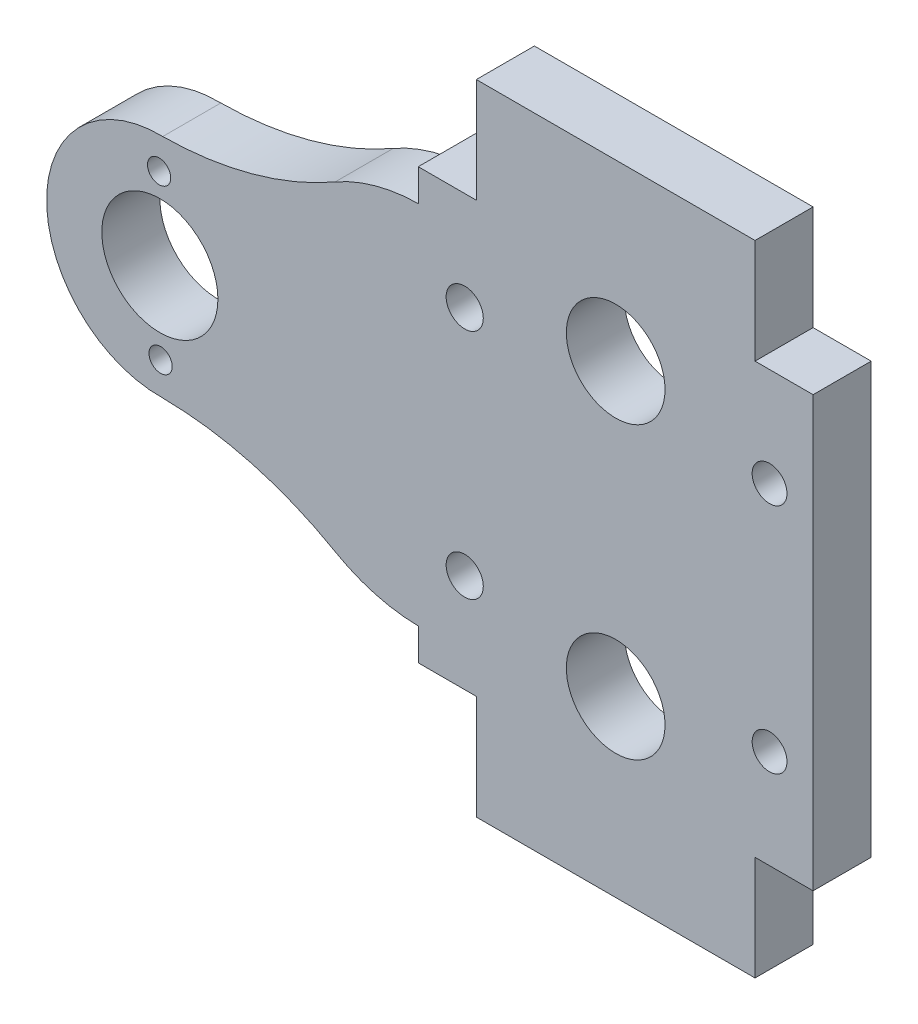
ISO-10303-21;
HEADER;
FILE_DESCRIPTION(('STEP AP214'),'2;1');
FILE_NAME('part.step','',(''),(''),'','','');
FILE_SCHEMA(('AUTOMOTIVE_DESIGN { 1 0 10303 214 1 1 1 1 }'));
ENDSEC;
DATA;
#1=APPLICATION_CONTEXT('core data for automotive mechanical design processes');
#2=APPLICATION_PROTOCOL_DEFINITION('international standard','automotive_design',2000,#1);
#3=PRODUCT_CONTEXT('',#1,'mechanical');
#4=PRODUCT('Part','Part','',(#3));
#5=PRODUCT_RELATED_PRODUCT_CATEGORY('part','',(#4));
#6=PRODUCT_DEFINITION_FORMATION('','',#4);
#7=PRODUCT_DEFINITION_CONTEXT('part definition',#1,'design');
#8=PRODUCT_DEFINITION('design','',#6,#7);
#9=PRODUCT_DEFINITION_SHAPE('','',#8);
#10=(LENGTH_UNIT() NAMED_UNIT(*) SI_UNIT(.MILLI.,.METRE.));
#11=(NAMED_UNIT(*) PLANE_ANGLE_UNIT() SI_UNIT($,.RADIAN.));
#12=(NAMED_UNIT(*) SI_UNIT($,.STERADIAN.) SOLID_ANGLE_UNIT());
#13=UNCERTAINTY_MEASURE_WITH_UNIT(LENGTH_MEASURE(1.E-05),#10,'distance_accuracy_value','');
#14=(GEOMETRIC_REPRESENTATION_CONTEXT(3) GLOBAL_UNCERTAINTY_ASSIGNED_CONTEXT((#13)) GLOBAL_UNIT_ASSIGNED_CONTEXT((#10,
#11,#12)) REPRESENTATION_CONTEXT('',''));
#15=CARTESIAN_POINT('',(0.,0.,0.));
#16=DIRECTION('',(0.,0.,1.));
#17=DIRECTION('',(1.,0.,0.));
#18=AXIS2_PLACEMENT_3D('',#15,#16,#17);
#19=CARTESIAN_POINT('',(16.700860260171,3.2922916539892,5.));
#20=DIRECTION('',(0.,0.,1.));
#21=DIRECTION('',(1.,0.,0.));
#22=AXIS2_PLACEMENT_3D('',#19,#20,#21);
#23=PLANE('',#22);
#24=CARTESIAN_POINT('',(20.5009159395274,-7.70770834601089,5.));
#25=DIRECTION('',(0.,0.,1.));
#26=DIRECTION('',(1.,0.,0.));
#27=AXIS2_PLACEMENT_3D('',#24,#25,#26);
#28=CIRCLE('',#27,1.6);
#29=CARTESIAN_POINT('',(22.1009159395274,-7.70770834601089,5.));
#30=VERTEX_POINT('',#29);
#31=EDGE_CURVE('E833',#30,#30,#28,.T.);
#32=ORIENTED_EDGE('',*,*,#31,.F.);
#33=EDGE_LOOP('',(#32));
#34=FACE_BOUND('',#33,.T.);
#35=CARTESIAN_POINT('',(20.5009159395274,12.2922916539891,5.));
#36=DIRECTION('',(0.,0.,1.));
#37=DIRECTION('',(1.,0.,0.));
#38=AXIS2_PLACEMENT_3D('',#35,#36,#37);
#39=CIRCLE('',#38,1.6);
#40=CARTESIAN_POINT('',(22.1009159395274,12.2922916539891,5.));
#41=VERTEX_POINT('',#40);
#42=EDGE_CURVE('E835',#41,#41,#39,.T.);
#43=ORIENTED_EDGE('',*,*,#42,.F.);
#44=EDGE_LOOP('',(#43));
#45=FACE_BOUND('',#44,.T.);
#46=DIRECTION('',(1.,0.,0.));
#47=VECTOR('',#46,1.);
#48=CARTESIAN_POINT('',(50.5009159395274,20.7922916539892,5.));
#49=LINE('',#48,#47);
#50=CARTESIAN_POINT('',(45.5009159395274,20.7922916539892,5.));
#51=VERTEX_POINT('',#50);
#52=CARTESIAN_POINT('',(50.5009159395274,20.7922916539892,5.));
#53=VERTEX_POINT('',#52);
#54=EDGE_CURVE('E241',#51,#53,#49,.T.);
#55=ORIENTED_EDGE('',*,*,#54,.F.);
#56=DIRECTION('',(0.,-1.,0.));
#57=VECTOR('',#56,1.);
#58=CARTESIAN_POINT('',(45.5009159395274,29.1887382633959,5.));
#59=LINE('',#58,#57);
#60=CARTESIAN_POINT('',(45.5009159395274,29.7922916539892,5.));
#61=VERTEX_POINT('',#60);
#62=EDGE_CURVE('E263',#61,#51,#59,.T.);
#63=ORIENTED_EDGE('',*,*,#62,.F.);
#64=DIRECTION('',(1.,0.,0.));
#65=VECTOR('',#64,1.);
#66=CARTESIAN_POINT('',(45.5009159395274,29.7922916539892,5.));
#67=LINE('',#66,#65);
#68=CARTESIAN_POINT('',(21.5009159395274,29.7922916539892,5.));
#69=VERTEX_POINT('',#68);
#70=EDGE_CURVE('E259',#69,#61,#67,.T.);
#71=ORIENTED_EDGE('',*,*,#70,.F.);
#72=DIRECTION('',(0.,1.,0.));
#73=VECTOR('',#72,1.);
#74=CARTESIAN_POINT('',(21.5009159395274,29.7922916539892,5.));
#75=LINE('',#74,#73);
#76=CARTESIAN_POINT('',(21.5009159395274,20.7922916539892,5.));
#77=VERTEX_POINT('',#76);
#78=EDGE_CURVE('E256',#77,#69,#75,.T.);
#79=ORIENTED_EDGE('',*,*,#78,.F.);
#80=DIRECTION('',(1.,0.,0.));
#81=VECTOR('',#80,1.);
#82=CARTESIAN_POINT('',(16.700860260171,20.7922916539892,5.));
#83=LINE('',#82,#81);
#84=CARTESIAN_POINT('',(16.5009159395274,20.7922916539892,5.));
#85=VERTEX_POINT('',#84);
#86=EDGE_CURVE('E186',#85,#77,#83,.T.);
#87=ORIENTED_EDGE('',*,*,#86,.F.);
#88=DIRECTION('',(0.,1.,0.));
#89=VECTOR('',#88,1.);
#90=CARTESIAN_POINT('',(16.5009159395274,20.7922916539892,5.));
#91=LINE('',#90,#89);
#92=CARTESIAN_POINT('',(16.5009159395274,18.0409364143949,5.));
#93=VERTEX_POINT('',#92);
#94=EDGE_CURVE('E209',#93,#85,#91,.T.);
#95=ORIENTED_EDGE('',*,*,#94,.F.);
#96=CARTESIAN_POINT('',(16.700860260171,3.2922916539892,5.));
#97=DIRECTION('',(0.,0.,1.));
#98=DIRECTION('',(1.,0.,0.));
#99=AXIS2_PLACEMENT_3D('',#96,#97,#98);
#100=CIRCLE('',#99,14.75);
#101=CARTESIAN_POINT('',(9.34226739951562,16.0756249873225,5.));
#102=VERTEX_POINT('',#101);
#103=EDGE_CURVE('E54',#93,#102,#100,.T.);
#104=ORIENTED_EDGE('',*,*,#103,.T.);
#105=CARTESIAN_POINT('',(-5.74908406047262,42.2922916539892,5.));
#106=DIRECTION('',(0.,0.,-1.));
#107=DIRECTION('',(1.,0.,0.));
#108=AXIS2_PLACEMENT_3D('',#105,#106,#107);
#109=CIRCLE('',#108,30.25);
#110=CARTESIAN_POINT('',(-5.49908406047263,12.0433247294808,5.));
#111=VERTEX_POINT('',#110);
#112=EDGE_CURVE('E339',#102,#111,#109,.T.);
#113=ORIENTED_EDGE('',*,*,#112,.T.);
#114=DIRECTION('',(3.06941559721248E-12,-1.,0.));
#115=VECTOR('',#114,1.);
#116=CARTESIAN_POINT('',(-5.49908406047263,12.0433247294808,5.));
#117=LINE('',#116,#115);
#118=CARTESIAN_POINT('',(-5.49908406047262,12.0390859987982,5.));
#119=VERTEX_POINT('',#118);
#120=EDGE_CURVE('E341',#111,#119,#117,.T.);
#121=ORIENTED_EDGE('',*,*,#120,.T.);
#122=CARTESIAN_POINT('',(-5.74908406047262,2.29229165398919,5.));
#123=DIRECTION('',(0.,0.,1.));
#124=DIRECTION('',(1.,0.,0.));
#125=AXIS2_PLACEMENT_3D('',#122,#123,#124);
#126=CIRCLE('',#125,9.75);
#127=CARTESIAN_POINT('',(-5.49908406047262,-7.45450269081977,5.));
#128=VERTEX_POINT('',#127);
#129=EDGE_CURVE('E343',#119,#128,#126,.T.);
#130=ORIENTED_EDGE('',*,*,#129,.T.);
#131=DIRECTION('',(4.09255412961497E-13,-1.,0.));
#132=VECTOR('',#131,1.);
#133=CARTESIAN_POINT('',(-5.49908406047262,-7.45450269081977,5.));
#134=LINE('',#133,#132);
#135=CARTESIAN_POINT('',(-5.49908406047262,-7.45874142150246,5.));
#136=VERTEX_POINT('',#135);
#137=EDGE_CURVE('E345',#128,#136,#134,.T.);
#138=ORIENTED_EDGE('',*,*,#137,.T.);
#139=CARTESIAN_POINT('',(-5.74908406047262,-37.7077083460108,5.));
#140=DIRECTION('',(0.,0.,-1.));
#141=DIRECTION('',(1.,0.,0.));
#142=AXIS2_PLACEMENT_3D('',#139,#140,#141);
#143=CIRCLE('',#142,30.25);
#144=CARTESIAN_POINT('',(9.3422673995156,-11.4910416793441,5.));
#145=VERTEX_POINT('',#144);
#146=EDGE_CURVE('E347',#136,#145,#143,.T.);
#147=ORIENTED_EDGE('',*,*,#146,.T.);
#148=CARTESIAN_POINT('',(16.700860260171,1.2922916539892,5.));
#149=DIRECTION('',(0.,0.,1.));
#150=DIRECTION('',(1.,0.,0.));
#151=AXIS2_PLACEMENT_3D('',#148,#149,#150);
#152=CIRCLE('',#151,14.75);
#153=CARTESIAN_POINT('',(16.5009159395274,-13.4563531064165,5.));
#154=VERTEX_POINT('',#153);
#155=EDGE_CURVE('E200',#145,#154,#152,.T.);
#156=ORIENTED_EDGE('',*,*,#155,.T.);
#157=DIRECTION('',(0.,1.,0.));
#158=VECTOR('',#157,1.);
#159=CARTESIAN_POINT('',(16.5009159395274,-13.4563531064165,5.));
#160=LINE('',#159,#158);
#161=CARTESIAN_POINT('',(16.5009159395274,-16.2077083460108,5.));
#162=VERTEX_POINT('',#161);
#163=EDGE_CURVE('E191',#162,#154,#160,.T.);
#164=ORIENTED_EDGE('',*,*,#163,.F.);
#165=DIRECTION('',(-1.,0.,0.));
#166=VECTOR('',#165,1.);
#167=CARTESIAN_POINT('',(16.700860260171,-16.2077083460108,5.));
#168=LINE('',#167,#166);
#169=CARTESIAN_POINT('',(21.5009159395274,-16.2077083460108,5.));
#170=VERTEX_POINT('',#169);
#171=EDGE_CURVE('E175',#170,#162,#168,.T.);
#172=ORIENTED_EDGE('',*,*,#171,.F.);
#173=DIRECTION('',(0.,1.,0.));
#174=VECTOR('',#173,1.);
#175=CARTESIAN_POINT('',(21.5009159395274,-25.2077083460108,5.));
#176=LINE('',#175,#174);
#177=CARTESIAN_POINT('',(21.5009159395274,-25.2077083460108,5.));
#178=VERTEX_POINT('',#177);
#179=EDGE_CURVE('E286',#178,#170,#176,.T.);
#180=ORIENTED_EDGE('',*,*,#179,.F.);
#181=DIRECTION('',(1.,0.,0.));
#182=VECTOR('',#181,1.);
#183=CARTESIAN_POINT('',(26.2509159395273,-25.2077083460108,5.));
#184=LINE('',#183,#182);
#185=CARTESIAN_POINT('',(45.5009159395274,-25.2077083460108,5.));
#186=VERTEX_POINT('',#185);
#187=EDGE_CURVE('E335',#178,#186,#184,.T.);
#188=ORIENTED_EDGE('',*,*,#187,.T.);
#189=DIRECTION('',(0.,-1.,0.));
#190=VECTOR('',#189,1.);
#191=CARTESIAN_POINT('',(45.5009159395274,-25.2077083460108,5.));
#192=LINE('',#191,#190);
#193=CARTESIAN_POINT('',(45.5009159395274,-16.2077083460108,5.));
#194=VERTEX_POINT('',#193);
#195=EDGE_CURVE('E277',#194,#186,#192,.T.);
#196=ORIENTED_EDGE('',*,*,#195,.F.);
#197=DIRECTION('',(-1.,0.,0.));
#198=VECTOR('',#197,1.);
#199=CARTESIAN_POINT('',(50.0009159395274,-16.2077083460108,5.));
#200=LINE('',#199,#198);
#201=CARTESIAN_POINT('',(50.5009159395274,-16.2077083460108,5.));
#202=VERTEX_POINT('',#201);
#203=EDGE_CURVE('E237',#202,#194,#200,.T.);
#204=ORIENTED_EDGE('',*,*,#203,.F.);
#205=DIRECTION('',(0.,-1.,0.));
#206=VECTOR('',#205,1.);
#207=CARTESIAN_POINT('',(50.5009159395274,-16.2077083460108,5.));
#208=LINE('',#207,#206);
#209=EDGE_CURVE('E234',#53,#202,#208,.T.);
#210=ORIENTED_EDGE('',*,*,#209,.F.);
#211=EDGE_LOOP('',(#55,#63,#71,#79,#87,#95,#104,#113,#121,#130,#138,#147,#156,#164,#172,#180,
#188,#196,#204,#210));
#212=FACE_BOUND('',#211,.T.);
#213=CARTESIAN_POINT('',(33.5009159395274,-10.2077083460108,5.));
#214=DIRECTION('',(0.,0.,1.));
#215=DIRECTION('',(1.,0.,0.));
#216=AXIS2_PLACEMENT_3D('',#213,#214,#215);
#217=CIRCLE('',#216,4.25000000000001);
#218=CARTESIAN_POINT('',(37.7509159395274,-10.2077083460108,5.));
#219=VERTEX_POINT('',#218);
#220=EDGE_CURVE('E311',#219,#219,#217,.T.);
#221=ORIENTED_EDGE('',*,*,#220,.F.);
#222=EDGE_LOOP('',(#221));
#223=FACE_BOUND('',#222,.T.);
#224=CARTESIAN_POINT('',(46.7509159395274,12.2922916539892,5.));
#225=DIRECTION('',(0.,0.,1.));
#226=DIRECTION('',(1.,0.,0.));
#227=AXIS2_PLACEMENT_3D('',#224,#225,#226);
#228=CIRCLE('',#227,1.5);
#229=CARTESIAN_POINT('',(48.2509159395274,12.2922916539892,5.));
#230=VERTEX_POINT('',#229);
#231=EDGE_CURVE('E323',#230,#230,#228,.T.);
#232=ORIENTED_EDGE('',*,*,#231,.F.);
#233=EDGE_LOOP('',(#232));
#234=FACE_BOUND('',#233,.T.);
#235=CARTESIAN_POINT('',(46.7509159395274,-7.70770834601081,5.));
#236=DIRECTION('',(0.,0.,1.));
#237=DIRECTION('',(1.,0.,0.));
#238=AXIS2_PLACEMENT_3D('',#235,#236,#237);
#239=CIRCLE('',#238,1.5);
#240=CARTESIAN_POINT('',(48.2509159395274,-7.70770834601081,5.));
#241=VERTEX_POINT('',#240);
#242=EDGE_CURVE('E329',#241,#241,#239,.T.);
#243=ORIENTED_EDGE('',*,*,#242,.F.);
#244=EDGE_LOOP('',(#243));
#245=FACE_BOUND('',#244,.T.);
#246=CARTESIAN_POINT('',(33.5009159395274,14.7922916539892,5.));
#247=DIRECTION('',(0.,0.,1.));
#248=DIRECTION('',(1.,0.,0.));
#249=AXIS2_PLACEMENT_3D('',#246,#247,#248);
#250=CIRCLE('',#249,4.25);
#251=CARTESIAN_POINT('',(37.7509159395274,14.7922916539892,5.));
#252=VERTEX_POINT('',#251);
#253=EDGE_CURVE('E317',#252,#252,#250,.T.);
#254=ORIENTED_EDGE('',*,*,#253,.F.);
#255=EDGE_LOOP('',(#254));
#256=FACE_BOUND('',#255,.T.);
#257=CARTESIAN_POINT('',(-5.74908406047262,2.29229165398919,5.));
#258=DIRECTION('',(0.,0.,1.));
#259=DIRECTION('',(1.,0.,0.));
#260=AXIS2_PLACEMENT_3D('',#257,#258,#259);
#261=CIRCLE('',#260,5.);
#262=CARTESIAN_POINT('',(-0.749084060472621,2.29229165398919,5.));
#263=VERTEX_POINT('',#262);
#264=EDGE_CURVE('E305',#263,#263,#261,.T.);
#265=ORIENTED_EDGE('',*,*,#264,.F.);
#266=EDGE_LOOP('',(#265));
#267=FACE_BOUND('',#266,.T.);
#268=CARTESIAN_POINT('',(-5.68662948504604,-4.70770834601081,5.));
#269=DIRECTION('',(0.,0.,1.));
#270=DIRECTION('',(1.,0.,0.));
#271=AXIS2_PLACEMENT_3D('',#268,#269,#270);
#272=CIRCLE('',#271,1.);
#273=CARTESIAN_POINT('',(-4.68662948504604,-4.70770834601081,5.));
#274=VERTEX_POINT('',#273);
#275=EDGE_CURVE('E299',#274,#274,#272,.T.);
#276=ORIENTED_EDGE('',*,*,#275,.F.);
#277=EDGE_LOOP('',(#276));
#278=FACE_BOUND('',#277,.T.);
#279=CARTESIAN_POINT('',(-5.8115386358992,9.29229165398919,5.));
#280=DIRECTION('',(0.,0.,1.));
#281=DIRECTION('',(1.,0.,0.));
#282=AXIS2_PLACEMENT_3D('',#279,#280,#281);
#283=CIRCLE('',#282,1.);
#284=CARTESIAN_POINT('',(-4.8115386358992,9.29229165398919,5.));
#285=VERTEX_POINT('',#284);
#286=EDGE_CURVE('E293',#285,#285,#283,.T.);
#287=ORIENTED_EDGE('',*,*,#286,.F.);
#288=EDGE_LOOP('',(#287));
#289=FACE_BOUND('',#288,.T.);
#290=ADVANCED_FACE('F39',(#34,#45,#212,#223,#234,#245,#256,#267,#278,#289),#23,.T.);
#291=CARTESIAN_POINT('',(16.700860260171,3.2922916539892,0.));
#292=DIRECTION('',(0.,0.,1.));
#293=DIRECTION('',(1.,0.,0.));
#294=AXIS2_PLACEMENT_3D('',#291,#292,#293);
#295=PLANE('',#294);
#296=DIRECTION('',(0.,-1.,0.));
#297=VECTOR('',#296,1.);
#298=CARTESIAN_POINT('',(45.5009159395274,29.1887382633959,0.));
#299=LINE('',#298,#297);
#300=CARTESIAN_POINT('',(45.5009159395274,29.7922916539892,0.));
#301=VERTEX_POINT('',#300);
#302=CARTESIAN_POINT('',(45.5009159395274,20.7922916539892,0.));
#303=VERTEX_POINT('',#302);
#304=EDGE_CURVE('E260',#301,#303,#299,.T.);
#305=ORIENTED_EDGE('',*,*,#304,.T.);
#306=DIRECTION('',(1.,0.,0.));
#307=VECTOR('',#306,1.);
#308=CARTESIAN_POINT('',(50.5009159395274,20.7922916539892,0.));
#309=LINE('',#308,#307);
#310=CARTESIAN_POINT('',(50.5009159395274,20.7922916539892,0.));
#311=VERTEX_POINT('',#310);
#312=EDGE_CURVE('E238',#303,#311,#309,.T.);
#313=ORIENTED_EDGE('',*,*,#312,.T.);
#314=DIRECTION('',(0.,-1.,0.));
#315=VECTOR('',#314,1.);
#316=CARTESIAN_POINT('',(50.5009159395274,-16.2077083460108,0.));
#317=LINE('',#316,#315);
#318=CARTESIAN_POINT('',(50.5009159395274,-16.2077083460108,0.));
#319=VERTEX_POINT('',#318);
#320=EDGE_CURVE('E233',#311,#319,#317,.T.);
#321=ORIENTED_EDGE('',*,*,#320,.T.);
#322=DIRECTION('',(-1.,0.,0.));
#323=VECTOR('',#322,1.);
#324=CARTESIAN_POINT('',(50.0009159395274,-16.2077083460108,0.));
#325=LINE('',#324,#323);
#326=CARTESIAN_POINT('',(45.5009159395274,-16.2077083460108,0.));
#327=VERTEX_POINT('',#326);
#328=EDGE_CURVE('E247',#319,#327,#325,.T.);
#329=ORIENTED_EDGE('',*,*,#328,.T.);
#330=DIRECTION('',(0.,-1.,0.));
#331=VECTOR('',#330,1.);
#332=CARTESIAN_POINT('',(45.5009159395274,-25.2077083460108,0.));
#333=LINE('',#332,#331);
#334=CARTESIAN_POINT('',(45.5009159395274,-25.2077083460108,0.));
#335=VERTEX_POINT('',#334);
#336=EDGE_CURVE('E275',#327,#335,#333,.T.);
#337=ORIENTED_EDGE('',*,*,#336,.T.);
#338=DIRECTION('',(1.,0.,0.));
#339=VECTOR('',#338,1.);
#340=CARTESIAN_POINT('',(26.2509159395273,-25.2077083460108,0.));
#341=LINE('',#340,#339);
#342=CARTESIAN_POINT('',(21.5009159395274,-25.2077083460108,0.));
#343=VERTEX_POINT('',#342);
#344=EDGE_CURVE('E332',#343,#335,#341,.T.);
#345=ORIENTED_EDGE('',*,*,#344,.F.);
#346=DIRECTION('',(0.,1.,0.));
#347=VECTOR('',#346,1.);
#348=CARTESIAN_POINT('',(21.5009159395274,-25.2077083460108,0.));
#349=LINE('',#348,#347);
#350=CARTESIAN_POINT('',(21.5009159395274,-16.2077083460108,0.));
#351=VERTEX_POINT('',#350);
#352=EDGE_CURVE('E285',#343,#351,#349,.T.);
#353=ORIENTED_EDGE('',*,*,#352,.T.);
#354=DIRECTION('',(1.,0.,0.));
#355=VECTOR('',#354,1.);
#356=CARTESIAN_POINT('',(21.2509159395274,-16.2077083460108,0.));
#357=LINE('',#356,#355);
#358=CARTESIAN_POINT('',(16.5009159395274,-16.2077083460108,0.));
#359=VERTEX_POINT('',#358);
#360=EDGE_CURVE('E223',#359,#351,#357,.T.);
#361=ORIENTED_EDGE('',*,*,#360,.F.);
#362=DIRECTION('',(0.,1.,0.));
#363=VECTOR('',#362,1.);
#364=CARTESIAN_POINT('',(16.5009159395274,-13.4563531064165,0.));
#365=LINE('',#364,#363);
#366=CARTESIAN_POINT('',(16.5009159395274,-13.4563531064165,0.));
#367=VERTEX_POINT('',#366);
#368=EDGE_CURVE('E194',#359,#367,#365,.T.);
#369=ORIENTED_EDGE('',*,*,#368,.T.);
#370=CARTESIAN_POINT('',(16.700860260171,1.2922916539892,0.));
#371=DIRECTION('',(0.,0.,1.));
#372=DIRECTION('',(1.,0.,0.));
#373=AXIS2_PLACEMENT_3D('',#370,#371,#372);
#374=CIRCLE('',#373,14.75);
#375=CARTESIAN_POINT('',(9.3422673995156,-11.4910416793441,0.));
#376=VERTEX_POINT('',#375);
#377=EDGE_CURVE('E337',#376,#367,#374,.T.);
#378=ORIENTED_EDGE('',*,*,#377,.F.);
#379=CARTESIAN_POINT('',(-5.74908406047262,-37.7077083460108,0.));
#380=DIRECTION('',(0.,0.,-1.));
#381=DIRECTION('',(1.,0.,0.));
#382=AXIS2_PLACEMENT_3D('',#379,#380,#381);
#383=CIRCLE('',#382,30.25);
#384=CARTESIAN_POINT('',(-5.49908406047262,-7.45874142150246,0.));
#385=VERTEX_POINT('',#384);
#386=EDGE_CURVE('E362',#385,#376,#383,.T.);
#387=ORIENTED_EDGE('',*,*,#386,.F.);
#388=DIRECTION('',(4.09255412961497E-13,-1.,0.));
#389=VECTOR('',#388,1.);
#390=CARTESIAN_POINT('',(-5.49908406047262,-7.45450269081977,0.));
#391=LINE('',#390,#389);
#392=CARTESIAN_POINT('',(-5.49908406047262,-7.45450269081977,0.));
#393=VERTEX_POINT('',#392);
#394=EDGE_CURVE('E360',#393,#385,#391,.T.);
#395=ORIENTED_EDGE('',*,*,#394,.F.);
#396=CARTESIAN_POINT('',(-5.74908406047262,2.29229165398919,0.));
#397=DIRECTION('',(0.,0.,1.));
#398=DIRECTION('',(1.,0.,0.));
#399=AXIS2_PLACEMENT_3D('',#396,#397,#398);
#400=CIRCLE('',#399,9.75);
#401=CARTESIAN_POINT('',(-5.49908406047262,12.0390859987982,0.));
#402=VERTEX_POINT('',#401);
#403=EDGE_CURVE('E358',#402,#393,#400,.T.);
#404=ORIENTED_EDGE('',*,*,#403,.F.);
#405=DIRECTION('',(3.06941559721248E-12,-1.,0.));
#406=VECTOR('',#405,1.);
#407=CARTESIAN_POINT('',(-5.49908406047263,12.0433247294808,0.));
#408=LINE('',#407,#406);
#409=CARTESIAN_POINT('',(-5.49908406047263,12.0433247294808,0.));
#410=VERTEX_POINT('',#409);
#411=EDGE_CURVE('E356',#410,#402,#408,.T.);
#412=ORIENTED_EDGE('',*,*,#411,.F.);
#413=CARTESIAN_POINT('',(-5.74908406047262,42.2922916539892,0.));
#414=DIRECTION('',(0.,0.,-1.));
#415=DIRECTION('',(1.,0.,0.));
#416=AXIS2_PLACEMENT_3D('',#413,#414,#415);
#417=CIRCLE('',#416,30.25);
#418=CARTESIAN_POINT('',(9.34226739951562,16.0756249873225,0.));
#419=VERTEX_POINT('',#418);
#420=EDGE_CURVE('E354',#419,#410,#417,.T.);
#421=ORIENTED_EDGE('',*,*,#420,.F.);
#422=CARTESIAN_POINT('',(16.700860260171,3.2922916539892,0.));
#423=DIRECTION('',(0.,0.,1.));
#424=DIRECTION('',(1.,0.,0.));
#425=AXIS2_PLACEMENT_3D('',#422,#423,#424);
#426=CIRCLE('',#425,14.75);
#427=CARTESIAN_POINT('',(16.5009159395274,18.0409364143949,0.));
#428=VERTEX_POINT('',#427);
#429=EDGE_CURVE('E352',#428,#419,#426,.T.);
#430=ORIENTED_EDGE('',*,*,#429,.F.);
#431=DIRECTION('',(0.,1.,0.));
#432=VECTOR('',#431,1.);
#433=CARTESIAN_POINT('',(16.5009159395274,20.7922916539892,0.));
#434=LINE('',#433,#432);
#435=CARTESIAN_POINT('',(16.5009159395274,20.7922916539892,0.));
#436=VERTEX_POINT('',#435);
#437=EDGE_CURVE('E207',#428,#436,#434,.T.);
#438=ORIENTED_EDGE('',*,*,#437,.T.);
#439=DIRECTION('',(-1.,0.,0.));
#440=VECTOR('',#439,1.);
#441=CARTESIAN_POINT('',(21.5009159395274,20.7922916539892,0.));
#442=LINE('',#441,#440);
#443=CARTESIAN_POINT('',(21.5009159395274,20.7922916539892,0.));
#444=VERTEX_POINT('',#443);
#445=EDGE_CURVE('E217',#444,#436,#442,.T.);
#446=ORIENTED_EDGE('',*,*,#445,.F.);
#447=DIRECTION('',(0.,1.,0.));
#448=VECTOR('',#447,1.);
#449=CARTESIAN_POINT('',(21.5009159395274,29.7922916539892,0.));
#450=LINE('',#449,#448);
#451=CARTESIAN_POINT('',(21.5009159395274,29.7922916539892,0.));
#452=VERTEX_POINT('',#451);
#453=EDGE_CURVE('E254',#444,#452,#450,.T.);
#454=ORIENTED_EDGE('',*,*,#453,.T.);
#455=DIRECTION('',(1.,0.,0.));
#456=VECTOR('',#455,1.);
#457=CARTESIAN_POINT('',(45.5009159395274,29.7922916539892,0.));
#458=LINE('',#457,#456);
#459=EDGE_CURVE('E269',#452,#301,#458,.T.);
#460=ORIENTED_EDGE('',*,*,#459,.T.);
#461=EDGE_LOOP('',(#305,#313,#321,#329,#337,#345,#353,#361,#369,#378,#387,#395,#404,#412,#421,
#430,#438,#446,#454,#460));
#462=FACE_BOUND('',#461,.T.);
#463=CARTESIAN_POINT('',(46.7509159395274,-7.70770834601081,0.));
#464=DIRECTION('',(0.,0.,1.));
#465=DIRECTION('',(1.,0.,0.));
#466=AXIS2_PLACEMENT_3D('',#463,#464,#465);
#467=CIRCLE('',#466,1.5);
#468=CARTESIAN_POINT('',(48.2509159395274,-7.70770834601081,0.));
#469=VERTEX_POINT('',#468);
#470=EDGE_CURVE('E326',#469,#469,#467,.T.);
#471=ORIENTED_EDGE('',*,*,#470,.T.);
#472=EDGE_LOOP('',(#471));
#473=FACE_BOUND('',#472,.T.);
#474=CARTESIAN_POINT('',(46.7509159395274,12.2922916539892,0.));
#475=DIRECTION('',(0.,0.,1.));
#476=DIRECTION('',(1.,0.,0.));
#477=AXIS2_PLACEMENT_3D('',#474,#475,#476);
#478=CIRCLE('',#477,1.5);
#479=CARTESIAN_POINT('',(48.2509159395274,12.2922916539892,0.));
#480=VERTEX_POINT('',#479);
#481=EDGE_CURVE('E320',#480,#480,#478,.T.);
#482=ORIENTED_EDGE('',*,*,#481,.T.);
#483=EDGE_LOOP('',(#482));
#484=FACE_BOUND('',#483,.T.);
#485=CARTESIAN_POINT('',(33.5009159395274,14.7922916539892,0.));
#486=DIRECTION('',(0.,0.,1.));
#487=DIRECTION('',(1.,0.,0.));
#488=AXIS2_PLACEMENT_3D('',#485,#486,#487);
#489=CIRCLE('',#488,4.25);
#490=CARTESIAN_POINT('',(37.7509159395274,14.7922916539892,0.));
#491=VERTEX_POINT('',#490);
#492=EDGE_CURVE('E314',#491,#491,#489,.T.);
#493=ORIENTED_EDGE('',*,*,#492,.T.);
#494=EDGE_LOOP('',(#493));
#495=FACE_BOUND('',#494,.T.);
#496=CARTESIAN_POINT('',(33.5009159395274,-10.2077083460108,0.));
#497=DIRECTION('',(0.,0.,1.));
#498=DIRECTION('',(1.,0.,0.));
#499=AXIS2_PLACEMENT_3D('',#496,#497,#498);
#500=CIRCLE('',#499,4.25000000000001);
#501=CARTESIAN_POINT('',(37.7509159395274,-10.2077083460108,0.));
#502=VERTEX_POINT('',#501);
#503=EDGE_CURVE('E308',#502,#502,#500,.T.);
#504=ORIENTED_EDGE('',*,*,#503,.T.);
#505=EDGE_LOOP('',(#504));
#506=FACE_BOUND('',#505,.T.);
#507=CARTESIAN_POINT('',(20.5009159395274,12.2922916539891,0.));
#508=DIRECTION('',(0.,0.,1.));
#509=DIRECTION('',(1.,0.,0.));
#510=AXIS2_PLACEMENT_3D('',#507,#508,#509);
#511=CIRCLE('',#510,1.6);
#512=CARTESIAN_POINT('',(22.1009159395274,12.2922916539891,0.));
#513=VERTEX_POINT('',#512);
#514=EDGE_CURVE('E202',#513,#513,#511,.T.);
#515=ORIENTED_EDGE('',*,*,#514,.T.);
#516=EDGE_LOOP('',(#515));
#517=FACE_BOUND('',#516,.T.);
#518=CARTESIAN_POINT('',(20.5009159395274,-7.70770834601089,0.));
#519=DIRECTION('',(0.,0.,1.));
#520=DIRECTION('',(1.,0.,0.));
#521=AXIS2_PLACEMENT_3D('',#518,#519,#520);
#522=CIRCLE('',#521,1.6);
#523=CARTESIAN_POINT('',(22.1009159395274,-7.70770834601089,0.));
#524=VERTEX_POINT('',#523);
#525=EDGE_CURVE('E823',#524,#524,#522,.T.);
#526=ORIENTED_EDGE('',*,*,#525,.T.);
#527=EDGE_LOOP('',(#526));
#528=FACE_BOUND('',#527,.T.);
#529=CARTESIAN_POINT('',(-5.74908406047262,2.29229165398919,0.));
#530=DIRECTION('',(0.,0.,1.));
#531=DIRECTION('',(1.,0.,0.));
#532=AXIS2_PLACEMENT_3D('',#529,#530,#531);
#533=CIRCLE('',#532,5.);
#534=CARTESIAN_POINT('',(-0.749084060472621,2.29229165398919,0.));
#535=VERTEX_POINT('',#534);
#536=EDGE_CURVE('E302',#535,#535,#533,.T.);
#537=ORIENTED_EDGE('',*,*,#536,.T.);
#538=EDGE_LOOP('',(#537));
#539=FACE_BOUND('',#538,.T.);
#540=CARTESIAN_POINT('',(-5.68662948504604,-4.70770834601081,0.));
#541=DIRECTION('',(0.,0.,1.));
#542=DIRECTION('',(1.,0.,0.));
#543=AXIS2_PLACEMENT_3D('',#540,#541,#542);
#544=CIRCLE('',#543,1.);
#545=CARTESIAN_POINT('',(-4.68662948504604,-4.70770834601081,0.));
#546=VERTEX_POINT('',#545);
#547=EDGE_CURVE('E296',#546,#546,#544,.T.);
#548=ORIENTED_EDGE('',*,*,#547,.T.);
#549=EDGE_LOOP('',(#548));
#550=FACE_BOUND('',#549,.T.);
#551=CARTESIAN_POINT('',(-5.8115386358992,9.29229165398919,0.));
#552=DIRECTION('',(0.,0.,1.));
#553=DIRECTION('',(1.,0.,0.));
#554=AXIS2_PLACEMENT_3D('',#551,#552,#553);
#555=CIRCLE('',#554,1.);
#556=CARTESIAN_POINT('',(-4.8115386358992,9.29229165398919,0.));
#557=VERTEX_POINT('',#556);
#558=EDGE_CURVE('E292',#557,#557,#555,.T.);
#559=ORIENTED_EDGE('',*,*,#558,.T.);
#560=EDGE_LOOP('',(#559));
#561=FACE_BOUND('',#560,.T.);
#562=ADVANCED_FACE('F388',(#462,#473,#484,#495,#506,#517,#528,#539,#550,#561),#295,.F.);
#563=CARTESIAN_POINT('',(26.2509159395273,-25.2077083460108,5.));
#564=DIRECTION('',(0.,1.,0.));
#565=DIRECTION('',(0.,0.,1.));
#566=AXIS2_PLACEMENT_3D('',#563,#564,#565);
#567=PLANE('',#566);
#568=ORIENTED_EDGE('',*,*,#344,.T.);
#569=DIRECTION('',(0.,0.,-1.));
#570=VECTOR('',#569,1.);
#571=CARTESIAN_POINT('',(45.5009159395274,-25.2077083460108,5.));
#572=LINE('',#571,#570);
#573=EDGE_CURVE('E280',#186,#335,#572,.T.);
#574=ORIENTED_EDGE('',*,*,#573,.F.);
#575=ORIENTED_EDGE('',*,*,#187,.F.);
#576=DIRECTION('',(0.,0.,-1.));
#577=VECTOR('',#576,1.);
#578=CARTESIAN_POINT('',(21.5009159395274,-25.2077083460108,5.));
#579=LINE('',#578,#577);
#580=EDGE_CURVE('E288',#178,#343,#579,.T.);
#581=ORIENTED_EDGE('',*,*,#580,.T.);
#582=EDGE_LOOP('',(#568,#574,#575,#581));
#583=FACE_BOUND('',#582,.T.);
#584=ADVANCED_FACE('F41',(#583),#567,.F.);
#585=CARTESIAN_POINT('',(16.700860260171,3.2922916539892,5.));
#586=DIRECTION('',(0.,0.,-1.));
#587=DIRECTION('',(-1.,0.,0.));
#588=AXIS2_PLACEMENT_3D('',#585,#586,#587);
#589=CYLINDRICAL_SURFACE('',#588,14.75);
#590=ORIENTED_EDGE('',*,*,#103,.F.);
#591=DIRECTION('',(0.,0.,-1.));
#592=VECTOR('',#591,1.);
#593=CARTESIAN_POINT('',(16.5009159395274,18.0409364143949,5.));
#594=LINE('',#593,#592);
#595=EDGE_CURVE('E58',#93,#428,#594,.T.);
#596=ORIENTED_EDGE('',*,*,#595,.T.);
#597=ORIENTED_EDGE('',*,*,#429,.T.);
#598=DIRECTION('',(0.,0.,-1.));
#599=VECTOR('',#598,1.);
#600=CARTESIAN_POINT('',(9.34226739951562,16.0756249873225,5.));
#601=LINE('',#600,#599);
#602=EDGE_CURVE('E11',#102,#419,#601,.T.);
#603=ORIENTED_EDGE('',*,*,#602,.F.);
#604=EDGE_LOOP('',(#590,#596,#597,#603));
#605=FACE_BOUND('',#604,.T.);
#606=ADVANCED_FACE('F404',(#605),#589,.T.);
#607=CARTESIAN_POINT('',(-5.74908406047262,42.2922916539892,5.));
#608=DIRECTION('',(0.,0.,-1.));
#609=DIRECTION('',(-1.,0.,0.));
#610=AXIS2_PLACEMENT_3D('',#607,#608,#609);
#611=CYLINDRICAL_SURFACE('',#610,30.25);
#612=ORIENTED_EDGE('',*,*,#420,.T.);
#613=DIRECTION('',(0.,0.,-1.));
#614=VECTOR('',#613,1.);
#615=CARTESIAN_POINT('',(-5.49908406047263,12.0433247294808,5.));
#616=LINE('',#615,#614);
#617=EDGE_CURVE('E47',#111,#410,#616,.T.);
#618=ORIENTED_EDGE('',*,*,#617,.F.);
#619=ORIENTED_EDGE('',*,*,#112,.F.);
#620=ORIENTED_EDGE('',*,*,#602,.T.);
#621=EDGE_LOOP('',(#612,#618,#619,#620));
#622=FACE_BOUND('',#621,.T.);
#623=ADVANCED_FACE('F403',(#622),#611,.F.);
#624=CARTESIAN_POINT('',(-5.49908406047263,12.0433247294808,5.));
#625=DIRECTION('',(1.,3.06941559721249E-12,0.));
#626=DIRECTION('',(-3.06941559721249E-12,1.,0.));
#627=AXIS2_PLACEMENT_3D('',#624,#625,#626);
#628=PLANE('',#627);
#629=ORIENTED_EDGE('',*,*,#411,.T.);
#630=DIRECTION('',(0.,0.,-1.));
#631=VECTOR('',#630,1.);
#632=CARTESIAN_POINT('',(-5.49908406047262,12.0390859987982,5.));
#633=LINE('',#632,#631);
#634=EDGE_CURVE('E374',#119,#402,#633,.T.);
#635=ORIENTED_EDGE('',*,*,#634,.F.);
#636=ORIENTED_EDGE('',*,*,#120,.F.);
#637=ORIENTED_EDGE('',*,*,#617,.T.);
#638=EDGE_LOOP('',(#629,#635,#636,#637));
#639=FACE_BOUND('',#638,.T.);
#640=ADVANCED_FACE('F381',(#639),#628,.F.);
#641=CARTESIAN_POINT('',(-5.74908406047262,2.29229165398919,5.));
#642=DIRECTION('',(0.,0.,-1.));
#643=DIRECTION('',(-1.,0.,0.));
#644=AXIS2_PLACEMENT_3D('',#641,#642,#643);
#645=CYLINDRICAL_SURFACE('',#644,9.75);
#646=ORIENTED_EDGE('',*,*,#403,.T.);
#647=DIRECTION('',(0.,0.,-1.));
#648=VECTOR('',#647,1.);
#649=CARTESIAN_POINT('',(-5.49908406047262,-7.45450269081977,5.));
#650=LINE('',#649,#648);
#651=EDGE_CURVE('E371',#128,#393,#650,.T.);
#652=ORIENTED_EDGE('',*,*,#651,.F.);
#653=ORIENTED_EDGE('',*,*,#129,.F.);
#654=ORIENTED_EDGE('',*,*,#634,.T.);
#655=EDGE_LOOP('',(#646,#652,#653,#654));
#656=FACE_BOUND('',#655,.T.);
#657=ADVANCED_FACE('F394',(#656),#645,.T.);
#658=CARTESIAN_POINT('',(-5.49908406047262,-7.45450269081977,5.));
#659=DIRECTION('',(1.,4.09255412961497E-13,0.));
#660=DIRECTION('',(-4.09255412961497E-13,1.,0.));
#661=AXIS2_PLACEMENT_3D('',#658,#659,#660);
#662=PLANE('',#661);
#663=ORIENTED_EDGE('',*,*,#394,.T.);
#664=DIRECTION('',(0.,0.,-1.));
#665=VECTOR('',#664,1.);
#666=CARTESIAN_POINT('',(-5.49908406047262,-7.45874142150246,5.));
#667=LINE('',#666,#665);
#668=EDGE_CURVE('E368',#136,#385,#667,.T.);
#669=ORIENTED_EDGE('',*,*,#668,.F.);
#670=ORIENTED_EDGE('',*,*,#137,.F.);
#671=ORIENTED_EDGE('',*,*,#651,.T.);
#672=EDGE_LOOP('',(#663,#669,#670,#671));
#673=FACE_BOUND('',#672,.T.);
#674=ADVANCED_FACE('F398',(#673),#662,.F.);
#675=CARTESIAN_POINT('',(-5.74908406047262,-37.7077083460108,5.));
#676=DIRECTION('',(0.,0.,-1.));
#677=DIRECTION('',(-1.,0.,0.));
#678=AXIS2_PLACEMENT_3D('',#675,#676,#677);
#679=CYLINDRICAL_SURFACE('',#678,30.25);
#680=ORIENTED_EDGE('',*,*,#386,.T.);
#681=DIRECTION('',(0.,0.,-1.));
#682=VECTOR('',#681,1.);
#683=CARTESIAN_POINT('',(9.3422673995156,-11.4910416793441,5.));
#684=LINE('',#683,#682);
#685=EDGE_CURVE('E350',#145,#376,#684,.T.);
#686=ORIENTED_EDGE('',*,*,#685,.F.);
#687=ORIENTED_EDGE('',*,*,#146,.F.);
#688=ORIENTED_EDGE('',*,*,#668,.T.);
#689=EDGE_LOOP('',(#680,#686,#687,#688));
#690=FACE_BOUND('',#689,.T.);
#691=ADVANCED_FACE('F471',(#690),#679,.F.);
#692=CARTESIAN_POINT('',(16.700860260171,1.2922916539892,5.));
#693=DIRECTION('',(0.,0.,-1.));
#694=DIRECTION('',(-1.,0.,0.));
#695=AXIS2_PLACEMENT_3D('',#692,#693,#694);
#696=CYLINDRICAL_SURFACE('',#695,14.75);
#697=ORIENTED_EDGE('',*,*,#377,.T.);
#698=DIRECTION('',(0.,0.,-1.));
#699=VECTOR('',#698,1.);
#700=CARTESIAN_POINT('',(16.5009159395274,-13.4563531064165,5.));
#701=LINE('',#700,#699);
#702=EDGE_CURVE('E195',#154,#367,#701,.T.);
#703=ORIENTED_EDGE('',*,*,#702,.F.);
#704=ORIENTED_EDGE('',*,*,#155,.F.);
#705=ORIENTED_EDGE('',*,*,#685,.T.);
#706=EDGE_LOOP('',(#697,#703,#704,#705));
#707=FACE_BOUND('',#706,.T.);
#708=ADVANCED_FACE('F468',(#707),#696,.T.);
#709=CARTESIAN_POINT('',(46.7509159395274,-7.70770834601081,5.));
#710=DIRECTION('',(0.,0.,-1.));
#711=DIRECTION('',(-1.,0.,0.));
#712=AXIS2_PLACEMENT_3D('',#709,#710,#711);
#713=CYLINDRICAL_SURFACE('',#712,1.5);
#714=ORIENTED_EDGE('',*,*,#242,.T.);
#715=EDGE_LOOP('',(#714));
#716=FACE_BOUND('',#715,.T.);
#717=ORIENTED_EDGE('',*,*,#470,.F.);
#718=EDGE_LOOP('',(#717));
#719=FACE_BOUND('',#718,.T.);
#720=ADVANCED_FACE('F465',(#716,#719),#713,.F.);
#721=CARTESIAN_POINT('',(46.7509159395274,12.2922916539892,5.));
#722=DIRECTION('',(0.,0.,-1.));
#723=DIRECTION('',(-1.,0.,0.));
#724=AXIS2_PLACEMENT_3D('',#721,#722,#723);
#725=CYLINDRICAL_SURFACE('',#724,1.5);
#726=ORIENTED_EDGE('',*,*,#231,.T.);
#727=EDGE_LOOP('',(#726));
#728=FACE_BOUND('',#727,.T.);
#729=ORIENTED_EDGE('',*,*,#481,.F.);
#730=EDGE_LOOP('',(#729));
#731=FACE_BOUND('',#730,.T.);
#732=ADVANCED_FACE('F757',(#728,#731),#725,.F.);
#733=CARTESIAN_POINT('',(33.5009159395274,14.7922916539892,5.));
#734=DIRECTION('',(0.,0.,-1.));
#735=DIRECTION('',(-1.,0.,0.));
#736=AXIS2_PLACEMENT_3D('',#733,#734,#735);
#737=CYLINDRICAL_SURFACE('',#736,4.25);
#738=ORIENTED_EDGE('',*,*,#253,.T.);
#739=EDGE_LOOP('',(#738));
#740=FACE_BOUND('',#739,.T.);
#741=ORIENTED_EDGE('',*,*,#492,.F.);
#742=EDGE_LOOP('',(#741));
#743=FACE_BOUND('',#742,.T.);
#744=ADVANCED_FACE('F748',(#740,#743),#737,.F.);
#745=CARTESIAN_POINT('',(33.5009159395274,-10.2077083460108,5.));
#746=DIRECTION('',(0.,0.,-1.));
#747=DIRECTION('',(-1.,0.,0.));
#748=AXIS2_PLACEMENT_3D('',#745,#746,#747);
#749=CYLINDRICAL_SURFACE('',#748,4.25000000000001);
#750=ORIENTED_EDGE('',*,*,#220,.T.);
#751=EDGE_LOOP('',(#750));
#752=FACE_BOUND('',#751,.T.);
#753=ORIENTED_EDGE('',*,*,#503,.F.);
#754=EDGE_LOOP('',(#753));
#755=FACE_BOUND('',#754,.T.);
#756=ADVANCED_FACE('F739',(#752,#755),#749,.F.);
#757=CARTESIAN_POINT('',(-5.74908406047262,2.29229165398919,5.));
#758=DIRECTION('',(0.,0.,-1.));
#759=DIRECTION('',(-1.,0.,0.));
#760=AXIS2_PLACEMENT_3D('',#757,#758,#759);
#761=CYLINDRICAL_SURFACE('',#760,5.);
#762=ORIENTED_EDGE('',*,*,#264,.T.);
#763=EDGE_LOOP('',(#762));
#764=FACE_BOUND('',#763,.T.);
#765=ORIENTED_EDGE('',*,*,#536,.F.);
#766=EDGE_LOOP('',(#765));
#767=FACE_BOUND('',#766,.T.);
#768=ADVANCED_FACE('F730',(#764,#767),#761,.F.);
#769=CARTESIAN_POINT('',(-5.68662948504604,-4.70770834601081,5.));
#770=DIRECTION('',(0.,0.,-1.));
#771=DIRECTION('',(-1.,0.,0.));
#772=AXIS2_PLACEMENT_3D('',#769,#770,#771);
#773=CYLINDRICAL_SURFACE('',#772,1.);
#774=ORIENTED_EDGE('',*,*,#275,.T.);
#775=EDGE_LOOP('',(#774));
#776=FACE_BOUND('',#775,.T.);
#777=ORIENTED_EDGE('',*,*,#547,.F.);
#778=EDGE_LOOP('',(#777));
#779=FACE_BOUND('',#778,.T.);
#780=ADVANCED_FACE('F452',(#776,#779),#773,.F.);
#781=CARTESIAN_POINT('',(-5.8115386358992,9.29229165398919,5.));
#782=DIRECTION('',(0.,0.,-1.));
#783=DIRECTION('',(-1.,0.,0.));
#784=AXIS2_PLACEMENT_3D('',#781,#782,#783);
#785=CYLINDRICAL_SURFACE('',#784,1.);
#786=ORIENTED_EDGE('',*,*,#286,.T.);
#787=EDGE_LOOP('',(#786));
#788=FACE_BOUND('',#787,.T.);
#789=ORIENTED_EDGE('',*,*,#558,.F.);
#790=EDGE_LOOP('',(#789));
#791=FACE_BOUND('',#790,.T.);
#792=ADVANCED_FACE('F445',(#788,#791),#785,.F.);
#793=CARTESIAN_POINT('',(21.5009159395274,-25.2077083460108,5.));
#794=DIRECTION('',(-1.,0.,0.));
#795=DIRECTION('',(0.,-1.,0.));
#796=AXIS2_PLACEMENT_3D('',#793,#794,#795);
#797=PLANE('',#796);
#798=ORIENTED_EDGE('',*,*,#352,.F.);
#799=ORIENTED_EDGE('',*,*,#580,.F.);
#800=ORIENTED_EDGE('',*,*,#179,.T.);
#801=DIRECTION('',(0.,0.,-1.));
#802=VECTOR('',#801,1.);
#803=CARTESIAN_POINT('',(21.5009159395274,-16.2077083460108,10.));
#804=LINE('',#803,#802);
#805=EDGE_CURVE('E182',#170,#351,#804,.T.);
#806=ORIENTED_EDGE('',*,*,#805,.T.);
#807=EDGE_LOOP('',(#798,#799,#800,#806));
#808=FACE_BOUND('',#807,.T.);
#809=ADVANCED_FACE('F443',(#808),#797,.T.);
#810=CARTESIAN_POINT('',(45.5009159395274,-25.2077083460108,5.));
#811=DIRECTION('',(1.,0.,0.));
#812=DIRECTION('',(0.,0.,-1.));
#813=AXIS2_PLACEMENT_3D('',#810,#811,#812);
#814=PLANE('',#813);
#815=ORIENTED_EDGE('',*,*,#336,.F.);
#816=DIRECTION('',(0.,0.,-1.));
#817=VECTOR('',#816,1.);
#818=CARTESIAN_POINT('',(45.5009159395274,-16.2077083460108,10.));
#819=LINE('',#818,#817);
#820=EDGE_CURVE('E187',#194,#327,#819,.T.);
#821=ORIENTED_EDGE('',*,*,#820,.F.);
#822=ORIENTED_EDGE('',*,*,#195,.T.);
#823=ORIENTED_EDGE('',*,*,#573,.T.);
#824=EDGE_LOOP('',(#815,#821,#822,#823));
#825=FACE_BOUND('',#824,.T.);
#826=ADVANCED_FACE('F437',(#825),#814,.T.);
#827=CARTESIAN_POINT('',(45.5009159395274,29.1887382633959,5.));
#828=DIRECTION('',(1.,0.,0.));
#829=DIRECTION('',(0.,0.,-1.));
#830=AXIS2_PLACEMENT_3D('',#827,#828,#829);
#831=PLANE('',#830);
#832=ORIENTED_EDGE('',*,*,#304,.F.);
#833=DIRECTION('',(0.,0.,-1.));
#834=VECTOR('',#833,1.);
#835=CARTESIAN_POINT('',(45.5009159395274,29.7922916539892,5.));
#836=LINE('',#835,#834);
#837=EDGE_CURVE('E273',#61,#301,#836,.T.);
#838=ORIENTED_EDGE('',*,*,#837,.F.);
#839=ORIENTED_EDGE('',*,*,#62,.T.);
#840=DIRECTION('',(0.,0.,-1.));
#841=VECTOR('',#840,1.);
#842=CARTESIAN_POINT('',(45.5009159395274,20.7922916539892,10.));
#843=LINE('',#842,#841);
#844=EDGE_CURVE('E224',#51,#303,#843,.T.);
#845=ORIENTED_EDGE('',*,*,#844,.T.);
#846=EDGE_LOOP('',(#832,#838,#839,#845));
#847=FACE_BOUND('',#846,.T.);
#848=ADVANCED_FACE('F422',(#847),#831,.T.);
#849=CARTESIAN_POINT('',(45.5009159395274,29.7922916539892,5.));
#850=DIRECTION('',(0.,1.,0.));
#851=DIRECTION('',(-1.,0.,0.));
#852=AXIS2_PLACEMENT_3D('',#849,#850,#851);
#853=PLANE('',#852);
#854=ORIENTED_EDGE('',*,*,#459,.F.);
#855=DIRECTION('',(0.,0.,-1.));
#856=VECTOR('',#855,1.);
#857=CARTESIAN_POINT('',(21.5009159395274,29.7922916539892,5.));
#858=LINE('',#857,#856);
#859=EDGE_CURVE('E266',#69,#452,#858,.T.);
#860=ORIENTED_EDGE('',*,*,#859,.F.);
#861=ORIENTED_EDGE('',*,*,#70,.T.);
#862=ORIENTED_EDGE('',*,*,#837,.T.);
#863=EDGE_LOOP('',(#854,#860,#861,#862));
#864=FACE_BOUND('',#863,.T.);
#865=ADVANCED_FACE('F419',(#864),#853,.T.);
#866=CARTESIAN_POINT('',(21.5009159395274,29.7922916539892,5.));
#867=DIRECTION('',(-1.,0.,0.));
#868=DIRECTION('',(0.,-1.,0.));
#869=AXIS2_PLACEMENT_3D('',#866,#867,#868);
#870=PLANE('',#869);
#871=ORIENTED_EDGE('',*,*,#453,.F.);
#872=DIRECTION('',(0.,0.,-1.));
#873=VECTOR('',#872,1.);
#874=CARTESIAN_POINT('',(21.5009159395274,20.7922916539892,10.));
#875=LINE('',#874,#873);
#876=EDGE_CURVE('E220',#77,#444,#875,.T.);
#877=ORIENTED_EDGE('',*,*,#876,.F.);
#878=ORIENTED_EDGE('',*,*,#78,.T.);
#879=ORIENTED_EDGE('',*,*,#859,.T.);
#880=EDGE_LOOP('',(#871,#877,#878,#879));
#881=FACE_BOUND('',#880,.T.);
#882=ADVANCED_FACE('F416',(#881),#870,.T.);
#883=CARTESIAN_POINT('',(50.5009159395274,-16.2077083460108,5.));
#884=DIRECTION('',(1.,0.,0.));
#885=DIRECTION('',(0.,1.,0.));
#886=AXIS2_PLACEMENT_3D('',#883,#884,#885);
#887=PLANE('',#886);
#888=ORIENTED_EDGE('',*,*,#320,.F.);
#889=DIRECTION('',(0.,0.,-1.));
#890=VECTOR('',#889,1.);
#891=CARTESIAN_POINT('',(50.5009159395274,20.7922916539892,5.));
#892=LINE('',#891,#890);
#893=EDGE_CURVE('E252',#53,#311,#892,.T.);
#894=ORIENTED_EDGE('',*,*,#893,.F.);
#895=ORIENTED_EDGE('',*,*,#209,.T.);
#896=DIRECTION('',(0.,0.,-1.));
#897=VECTOR('',#896,1.);
#898=CARTESIAN_POINT('',(50.5009159395274,-16.2077083460108,5.));
#899=LINE('',#898,#897);
#900=EDGE_CURVE('E244',#202,#319,#899,.T.);
#901=ORIENTED_EDGE('',*,*,#900,.T.);
#902=EDGE_LOOP('',(#888,#894,#895,#901));
#903=FACE_BOUND('',#902,.T.);
#904=ADVANCED_FACE('F430',(#903),#887,.T.);
#905=CARTESIAN_POINT('',(50.5009159395274,20.7922916539892,5.));
#906=DIRECTION('',(0.,1.,0.));
#907=DIRECTION('',(-1.,0.,0.));
#908=AXIS2_PLACEMENT_3D('',#905,#906,#907);
#909=PLANE('',#908);
#910=ORIENTED_EDGE('',*,*,#312,.F.);
#911=ORIENTED_EDGE('',*,*,#844,.F.);
#912=ORIENTED_EDGE('',*,*,#54,.T.);
#913=ORIENTED_EDGE('',*,*,#893,.T.);
#914=EDGE_LOOP('',(#910,#911,#912,#913));
#915=FACE_BOUND('',#914,.T.);
#916=ADVANCED_FACE('F426',(#915),#909,.T.);
#917=CARTESIAN_POINT('',(50.0009159395274,-16.2077083460108,5.));
#918=DIRECTION('',(0.,-1.,0.));
#919=DIRECTION('',(0.,0.,-1.));
#920=AXIS2_PLACEMENT_3D('',#917,#918,#919);
#921=PLANE('',#920);
#922=ORIENTED_EDGE('',*,*,#328,.F.);
#923=ORIENTED_EDGE('',*,*,#900,.F.);
#924=ORIENTED_EDGE('',*,*,#203,.T.);
#925=ORIENTED_EDGE('',*,*,#820,.T.);
#926=EDGE_LOOP('',(#922,#923,#924,#925));
#927=FACE_BOUND('',#926,.T.);
#928=ADVANCED_FACE('F434',(#927),#921,.T.);
#929=CARTESIAN_POINT('',(21.5009159395274,20.7922916539892,10.));
#930=DIRECTION('',(0.,-1.,0.));
#931=DIRECTION('',(0.,0.,-1.));
#932=AXIS2_PLACEMENT_3D('',#929,#930,#931);
#933=PLANE('',#932);
#934=ORIENTED_EDGE('',*,*,#86,.T.);
#935=ORIENTED_EDGE('',*,*,#876,.T.);
#936=ORIENTED_EDGE('',*,*,#445,.T.);
#937=DIRECTION('',(0.,0.,-1.));
#938=VECTOR('',#937,1.);
#939=CARTESIAN_POINT('',(16.5009159395274,20.7922916539892,5.));
#940=LINE('',#939,#938);
#941=EDGE_CURVE('E214',#85,#436,#940,.T.);
#942=ORIENTED_EDGE('',*,*,#941,.F.);
#943=EDGE_LOOP('',(#934,#935,#936,#942));
#944=FACE_BOUND('',#943,.T.);
#945=ADVANCED_FACE('F411',(#944),#933,.F.);
#946=CARTESIAN_POINT('',(21.2509159395274,-16.2077083460108,10.));
#947=DIRECTION('',(0.,1.,0.));
#948=DIRECTION('',(0.,0.,1.));
#949=AXIS2_PLACEMENT_3D('',#946,#947,#948);
#950=PLANE('',#949);
#951=ORIENTED_EDGE('',*,*,#171,.T.);
#952=DIRECTION('',(0.,0.,-1.));
#953=VECTOR('',#952,1.);
#954=CARTESIAN_POINT('',(16.5009159395274,-16.2077083460108,5.));
#955=LINE('',#954,#953);
#956=EDGE_CURVE('E179',#162,#359,#955,.T.);
#957=ORIENTED_EDGE('',*,*,#956,.T.);
#958=ORIENTED_EDGE('',*,*,#360,.T.);
#959=ORIENTED_EDGE('',*,*,#805,.F.);
#960=EDGE_LOOP('',(#951,#957,#958,#959));
#961=FACE_BOUND('',#960,.T.);
#962=ADVANCED_FACE('F177',(#961),#950,.F.);
#963=CARTESIAN_POINT('',(16.5009159395274,20.7922916539892,5.));
#964=DIRECTION('',(-1.,0.,0.));
#965=DIRECTION('',(0.,-1.,0.));
#966=AXIS2_PLACEMENT_3D('',#963,#964,#965);
#967=PLANE('',#966);
#968=ORIENTED_EDGE('',*,*,#437,.F.);
#969=ORIENTED_EDGE('',*,*,#595,.F.);
#970=ORIENTED_EDGE('',*,*,#94,.T.);
#971=ORIENTED_EDGE('',*,*,#941,.T.);
#972=EDGE_LOOP('',(#968,#969,#970,#971));
#973=FACE_BOUND('',#972,.T.);
#974=ADVANCED_FACE('F408',(#973),#967,.T.);
#975=CARTESIAN_POINT('',(16.5009159395274,-13.4563531064165,5.));
#976=DIRECTION('',(-1.,0.,0.));
#977=DIRECTION('',(0.,-1.,0.));
#978=AXIS2_PLACEMENT_3D('',#975,#976,#977);
#979=PLANE('',#978);
#980=ORIENTED_EDGE('',*,*,#368,.F.);
#981=ORIENTED_EDGE('',*,*,#956,.F.);
#982=ORIENTED_EDGE('',*,*,#163,.T.);
#983=ORIENTED_EDGE('',*,*,#702,.T.);
#984=EDGE_LOOP('',(#980,#981,#982,#983));
#985=FACE_BOUND('',#984,.T.);
#986=ADVANCED_FACE('F190',(#985),#979,.T.);
#987=CARTESIAN_POINT('',(20.5009159395274,-7.70770834601089,-5.));
#988=DIRECTION('',(0.,0.,1.));
#989=DIRECTION('',(1.,0.,0.));
#990=AXIS2_PLACEMENT_3D('',#987,#988,#989);
#991=CYLINDRICAL_SURFACE('',#990,1.6);
#992=ORIENTED_EDGE('',*,*,#31,.T.);
#993=EDGE_LOOP('',(#992));
#994=FACE_BOUND('',#993,.T.);
#995=ORIENTED_EDGE('',*,*,#525,.F.);
#996=EDGE_LOOP('',(#995));
#997=FACE_BOUND('',#996,.T.);
#998=ADVANCED_FACE('F511',(#994,#997),#991,.F.);
#999=CARTESIAN_POINT('',(20.5009159395274,12.2922916539891,-5.));
#1000=DIRECTION('',(0.,0.,1.));
#1001=DIRECTION('',(1.,0.,0.));
#1002=AXIS2_PLACEMENT_3D('',#999,#1000,#1001);
#1003=CYLINDRICAL_SURFACE('',#1002,1.6);
#1004=ORIENTED_EDGE('',*,*,#42,.T.);
#1005=EDGE_LOOP('',(#1004));
#1006=FACE_BOUND('',#1005,.T.);
#1007=ORIENTED_EDGE('',*,*,#514,.F.);
#1008=EDGE_LOOP('',(#1007));
#1009=FACE_BOUND('',#1008,.T.);
#1010=ADVANCED_FACE('F506',(#1006,#1009),#1003,.F.);
#1011=CLOSED_SHELL('',(#290,#562,#584,#606,#623,#640,#657,#674,#691,#708,#720,#732,#744,#756,
#768,#780,#792,#809,#826,#848,#865,#882,#904,#916,#928,#945,#962,#974,#986,#998,#1010));
#1012=MANIFOLD_SOLID_BREP('B2',#1011);
#1013=ADVANCED_BREP_SHAPE_REPRESENTATION('',(#18,#1012),#14);
#1014=SHAPE_DEFINITION_REPRESENTATION(#9,#1013);
ENDSEC;
END-ISO-10303-21;
